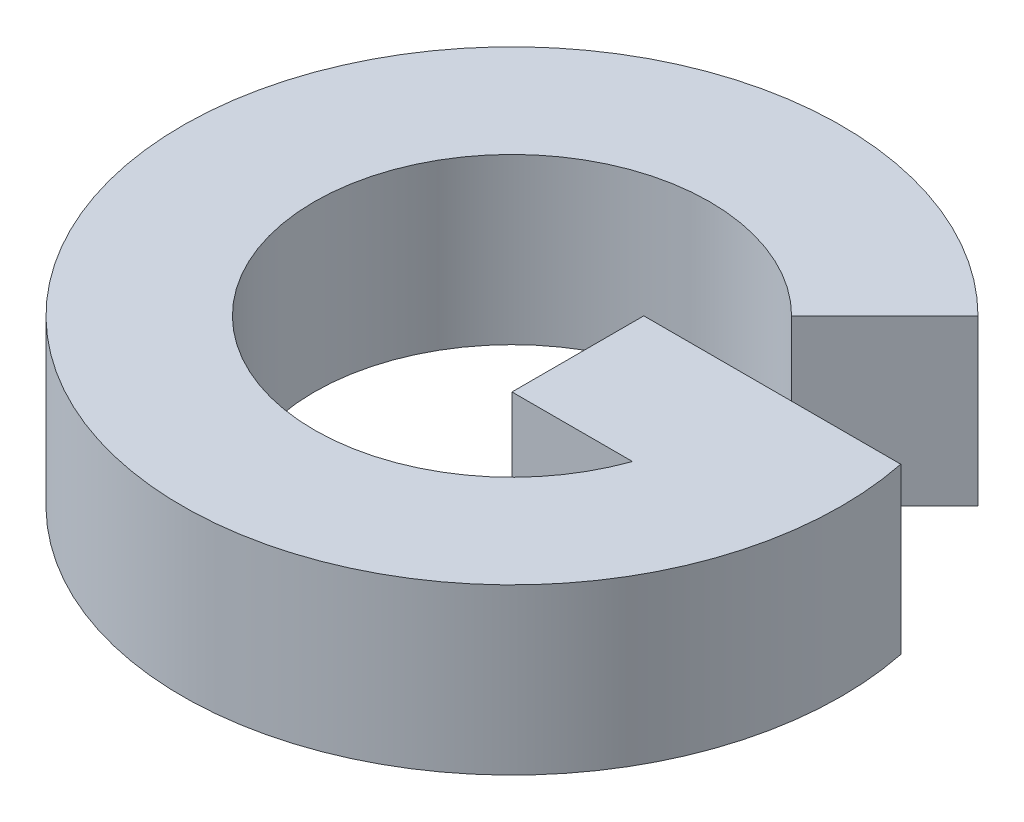
ISO-10303-21;
HEADER;
FILE_DESCRIPTION(('STEP AP214'),'2;1');
FILE_NAME('part.step','',(''),(''),'','','');
FILE_SCHEMA(('AUTOMOTIVE_DESIGN { 1 0 10303 214 1 1 1 1 }'));
ENDSEC;
DATA;
#1=APPLICATION_CONTEXT('core data for automotive mechanical design processes');
#2=APPLICATION_PROTOCOL_DEFINITION('international standard','automotive_design',2000,#1);
#3=PRODUCT_CONTEXT('',#1,'mechanical');
#4=PRODUCT('Part','Part','',(#3));
#5=PRODUCT_RELATED_PRODUCT_CATEGORY('part','',(#4));
#6=PRODUCT_DEFINITION_FORMATION('','',#4);
#7=PRODUCT_DEFINITION_CONTEXT('part definition',#1,'design');
#8=PRODUCT_DEFINITION('design','',#6,#7);
#9=PRODUCT_DEFINITION_SHAPE('','',#8);
#10=(LENGTH_UNIT() NAMED_UNIT(*) SI_UNIT(.MILLI.,.METRE.));
#11=(NAMED_UNIT(*) PLANE_ANGLE_UNIT() SI_UNIT($,.RADIAN.));
#12=(NAMED_UNIT(*) SI_UNIT($,.STERADIAN.) SOLID_ANGLE_UNIT());
#13=UNCERTAINTY_MEASURE_WITH_UNIT(LENGTH_MEASURE(1.E-05),#10,'distance_accuracy_value','');
#14=(GEOMETRIC_REPRESENTATION_CONTEXT(3) GLOBAL_UNCERTAINTY_ASSIGNED_CONTEXT((#13)) GLOBAL_UNIT_ASSIGNED_CONTEXT((#10,
#11,#12)) REPRESENTATION_CONTEXT('',''));
#15=CARTESIAN_POINT('',(0.,0.,0.));
#16=DIRECTION('',(0.,0.,1.));
#17=DIRECTION('',(1.,0.,0.));
#18=AXIS2_PLACEMENT_3D('',#15,#16,#17);
#19=CARTESIAN_POINT('',(320.,10.,-20.));
#20=DIRECTION('',(0.,-1.,0.));
#21=DIRECTION('',(0.,0.,-1.));
#22=AXIS2_PLACEMENT_3D('',#19,#20,#21);
#23=CYLINDRICAL_SURFACE('',#22,12.);
#24=CARTESIAN_POINT('',(320.,0.,-20.));
#25=DIRECTION('',(0.,-1.,0.));
#26=DIRECTION('',(0.,0.,1.));
#27=AXIS2_PLACEMENT_3D('',#24,#25,#26);
#28=CIRCLE('',#27,12.);
#29=CARTESIAN_POINT('',(331.313708498985,0.,-16.));
#30=VERTEX_POINT('',#29);
#31=CARTESIAN_POINT('',(328.485281374239,0.,-28.4852813742386));
#32=VERTEX_POINT('',#31);
#33=EDGE_CURVE('E116',#30,#32,#28,.T.);
#34=ORIENTED_EDGE('',*,*,#33,.T.);
#35=DIRECTION('',(0.,-1.,0.));
#36=VECTOR('',#35,1.);
#37=CARTESIAN_POINT('',(328.485281374239,10.,-28.4852813742386));
#38=LINE('',#37,#36);
#39=CARTESIAN_POINT('',(328.485281374239,10.,-28.4852813742386));
#40=VERTEX_POINT('',#39);
#41=EDGE_CURVE('E11',#40,#32,#38,.T.);
#42=ORIENTED_EDGE('',*,*,#41,.F.);
#43=CARTESIAN_POINT('',(320.,10.,-20.));
#44=DIRECTION('',(0.,-1.,0.));
#45=DIRECTION('',(0.,0.,1.));
#46=AXIS2_PLACEMENT_3D('',#43,#44,#45);
#47=CIRCLE('',#46,12.);
#48=CARTESIAN_POINT('',(331.313708498985,10.,-16.));
#49=VERTEX_POINT('',#48);
#50=EDGE_CURVE('E126',#49,#40,#47,.T.);
#51=ORIENTED_EDGE('',*,*,#50,.F.);
#52=DIRECTION('',(0.,-1.,0.));
#53=VECTOR('',#52,1.);
#54=CARTESIAN_POINT('',(331.313708498985,10.,-16.));
#55=LINE('',#54,#53);
#56=EDGE_CURVE('E112',#49,#30,#55,.T.);
#57=ORIENTED_EDGE('',*,*,#56,.T.);
#58=EDGE_LOOP('',(#34,#42,#51,#57));
#59=FACE_BOUND('',#58,.T.);
#60=ADVANCED_FACE('F32',(#59),#23,.F.);
#61=CARTESIAN_POINT('',(328.485281374239,10.,-28.4852813742386));
#62=DIRECTION('',(-0.707106781186549,0.,-0.707106781186546));
#63=DIRECTION('',(-0.707106781186546,0.,0.707106781186549));
#64=AXIS2_PLACEMENT_3D('',#61,#62,#63);
#65=PLANE('',#64);
#66=DIRECTION('',(0.707106781186546,0.,-0.707106781186549));
#67=VECTOR('',#66,1.);
#68=CARTESIAN_POINT('',(328.485281374239,0.,-28.4852813742386));
#69=LINE('',#68,#67);
#70=CARTESIAN_POINT('',(334.142135623731,0.,-34.142135623731));
#71=VERTEX_POINT('',#70);
#72=EDGE_CURVE('E119',#32,#71,#69,.T.);
#73=ORIENTED_EDGE('',*,*,#72,.T.);
#74=DIRECTION('',(0.,-1.,0.));
#75=VECTOR('',#74,1.);
#76=CARTESIAN_POINT('',(334.142135623731,10.,-34.142135623731));
#77=LINE('',#76,#75);
#78=CARTESIAN_POINT('',(334.142135623731,10.,-34.142135623731));
#79=VERTEX_POINT('',#78);
#80=EDGE_CURVE('E40',#79,#71,#77,.T.);
#81=ORIENTED_EDGE('',*,*,#80,.F.);
#82=DIRECTION('',(0.707106781186546,0.,-0.707106781186549));
#83=VECTOR('',#82,1.);
#84=CARTESIAN_POINT('',(328.485281374239,10.,-28.4852813742386));
#85=LINE('',#84,#83);
#86=EDGE_CURVE('E85',#40,#79,#85,.T.);
#87=ORIENTED_EDGE('',*,*,#86,.F.);
#88=ORIENTED_EDGE('',*,*,#41,.T.);
#89=EDGE_LOOP('',(#73,#81,#87,#88));
#90=FACE_BOUND('',#89,.T.);
#91=ADVANCED_FACE('F150',(#90),#65,.F.);
#92=CARTESIAN_POINT('',(320.,10.,-20.));
#93=DIRECTION('',(0.,-1.,0.));
#94=DIRECTION('',(0.,0.,-1.));
#95=AXIS2_PLACEMENT_3D('',#92,#93,#94);
#96=CYLINDRICAL_SURFACE('',#95,20.);
#97=CARTESIAN_POINT('',(320.,0.,-20.));
#98=DIRECTION('',(0.,1.,0.));
#99=DIRECTION('',(0.,0.,1.));
#100=AXIS2_PLACEMENT_3D('',#97,#98,#99);
#101=CIRCLE('',#100,20.);
#102=CARTESIAN_POINT('',(339.595917942265,0.,-24.));
#103=VERTEX_POINT('',#102);
#104=EDGE_CURVE('E121',#71,#103,#101,.T.);
#105=ORIENTED_EDGE('',*,*,#104,.T.);
#106=DIRECTION('',(0.,-1.,0.));
#107=VECTOR('',#106,1.);
#108=CARTESIAN_POINT('',(339.595917942265,10.,-24.));
#109=LINE('',#108,#107);
#110=CARTESIAN_POINT('',(339.595917942265,10.,-24.));
#111=VERTEX_POINT('',#110);
#112=EDGE_CURVE('E107',#111,#103,#109,.T.);
#113=ORIENTED_EDGE('',*,*,#112,.F.);
#114=CARTESIAN_POINT('',(320.,10.,-20.));
#115=DIRECTION('',(0.,1.,0.));
#116=DIRECTION('',(0.,0.,1.));
#117=AXIS2_PLACEMENT_3D('',#114,#115,#116);
#118=CIRCLE('',#117,20.);
#119=EDGE_CURVE('E98',#79,#111,#118,.T.);
#120=ORIENTED_EDGE('',*,*,#119,.F.);
#121=ORIENTED_EDGE('',*,*,#80,.T.);
#122=EDGE_LOOP('',(#105,#113,#120,#121));
#123=FACE_BOUND('',#122,.T.);
#124=ADVANCED_FACE('F132',(#123),#96,.T.);
#125=CARTESIAN_POINT('',(324.,10.,-24.));
#126=DIRECTION('',(0.,0.,1.));
#127=DIRECTION('',(1.,0.,0.));
#128=AXIS2_PLACEMENT_3D('',#125,#126,#127);
#129=PLANE('',#128);
#130=DIRECTION('',(-1.,0.,0.));
#131=VECTOR('',#130,1.);
#132=CARTESIAN_POINT('',(324.,0.,-24.));
#133=LINE('',#132,#131);
#134=CARTESIAN_POINT('',(324.,0.,-24.));
#135=VERTEX_POINT('',#134);
#136=EDGE_CURVE('E106',#103,#135,#133,.T.);
#137=ORIENTED_EDGE('',*,*,#136,.T.);
#138=DIRECTION('',(0.,-1.,0.));
#139=VECTOR('',#138,1.);
#140=CARTESIAN_POINT('',(324.,10.,-24.));
#141=LINE('',#140,#139);
#142=CARTESIAN_POINT('',(324.,10.,-24.));
#143=VERTEX_POINT('',#142);
#144=EDGE_CURVE('E103',#143,#135,#141,.T.);
#145=ORIENTED_EDGE('',*,*,#144,.F.);
#146=DIRECTION('',(-1.,0.,0.));
#147=VECTOR('',#146,1.);
#148=CARTESIAN_POINT('',(324.,10.,-24.));
#149=LINE('',#148,#147);
#150=EDGE_CURVE('E92',#111,#143,#149,.T.);
#151=ORIENTED_EDGE('',*,*,#150,.F.);
#152=ORIENTED_EDGE('',*,*,#112,.T.);
#153=EDGE_LOOP('',(#137,#145,#151,#152));
#154=FACE_BOUND('',#153,.T.);
#155=ADVANCED_FACE('F104',(#154),#129,.F.);
#156=CARTESIAN_POINT('',(324.,10.,-16.));
#157=DIRECTION('',(1.,0.,0.));
#158=DIRECTION('',(0.,0.,-1.));
#159=AXIS2_PLACEMENT_3D('',#156,#157,#158);
#160=PLANE('',#159);
#161=DIRECTION('',(0.,0.,1.));
#162=VECTOR('',#161,1.);
#163=CARTESIAN_POINT('',(324.,0.,-16.));
#164=LINE('',#163,#162);
#165=CARTESIAN_POINT('',(324.,0.,-16.));
#166=VERTEX_POINT('',#165);
#167=EDGE_CURVE('E71',#135,#166,#164,.T.);
#168=ORIENTED_EDGE('',*,*,#167,.T.);
#169=DIRECTION('',(0.,-1.,0.));
#170=VECTOR('',#169,1.);
#171=CARTESIAN_POINT('',(324.,10.,-16.));
#172=LINE('',#171,#170);
#173=CARTESIAN_POINT('',(324.,10.,-16.));
#174=VERTEX_POINT('',#173);
#175=EDGE_CURVE('E108',#174,#166,#172,.T.);
#176=ORIENTED_EDGE('',*,*,#175,.F.);
#177=DIRECTION('',(0.,0.,1.));
#178=VECTOR('',#177,1.);
#179=CARTESIAN_POINT('',(324.,10.,-16.));
#180=LINE('',#179,#178);
#181=EDGE_CURVE('E96',#143,#174,#180,.T.);
#182=ORIENTED_EDGE('',*,*,#181,.F.);
#183=ORIENTED_EDGE('',*,*,#144,.T.);
#184=EDGE_LOOP('',(#168,#176,#182,#183));
#185=FACE_BOUND('',#184,.T.);
#186=ADVANCED_FACE('F110',(#185),#160,.F.);
#187=CARTESIAN_POINT('',(324.,10.,-16.));
#188=DIRECTION('',(0.,0.,-1.));
#189=DIRECTION('',(-1.,0.,0.));
#190=AXIS2_PLACEMENT_3D('',#187,#188,#189);
#191=PLANE('',#190);
#192=DIRECTION('',(1.,0.,0.));
#193=VECTOR('',#192,1.);
#194=CARTESIAN_POINT('',(324.,0.,-16.));
#195=LINE('',#194,#193);
#196=EDGE_CURVE('E77',#166,#30,#195,.T.);
#197=ORIENTED_EDGE('',*,*,#196,.T.);
#198=ORIENTED_EDGE('',*,*,#56,.F.);
#199=DIRECTION('',(1.,0.,0.));
#200=VECTOR('',#199,1.);
#201=CARTESIAN_POINT('',(324.,10.,-16.));
#202=LINE('',#201,#200);
#203=EDGE_CURVE('E48',#174,#49,#202,.T.);
#204=ORIENTED_EDGE('',*,*,#203,.F.);
#205=ORIENTED_EDGE('',*,*,#175,.T.);
#206=EDGE_LOOP('',(#197,#198,#204,#205));
#207=FACE_BOUND('',#206,.T.);
#208=ADVANCED_FACE('F139',(#207),#191,.F.);
#209=CARTESIAN_POINT('',(320.,10.,-20.));
#210=DIRECTION('',(0.,1.,0.));
#211=DIRECTION('',(0.,0.,1.));
#212=AXIS2_PLACEMENT_3D('',#209,#210,#211);
#213=PLANE('',#212);
#214=ORIENTED_EDGE('',*,*,#50,.T.);
#215=ORIENTED_EDGE('',*,*,#86,.T.);
#216=ORIENTED_EDGE('',*,*,#119,.T.);
#217=ORIENTED_EDGE('',*,*,#150,.T.);
#218=ORIENTED_EDGE('',*,*,#181,.T.);
#219=ORIENTED_EDGE('',*,*,#203,.T.);
#220=EDGE_LOOP('',(#214,#215,#216,#217,#218,#219));
#221=FACE_BOUND('',#220,.T.);
#222=ADVANCED_FACE('F94',(#221),#213,.T.);
#223=CARTESIAN_POINT('',(320.,0.,-20.));
#224=DIRECTION('',(0.,1.,0.));
#225=DIRECTION('',(0.,0.,1.));
#226=AXIS2_PLACEMENT_3D('',#223,#224,#225);
#227=PLANE('',#226);
#228=ORIENTED_EDGE('',*,*,#33,.F.);
#229=ORIENTED_EDGE('',*,*,#196,.F.);
#230=ORIENTED_EDGE('',*,*,#167,.F.);
#231=ORIENTED_EDGE('',*,*,#136,.F.);
#232=ORIENTED_EDGE('',*,*,#104,.F.);
#233=ORIENTED_EDGE('',*,*,#72,.F.);
#234=EDGE_LOOP('',(#228,#229,#230,#231,#232,#233));
#235=FACE_BOUND('',#234,.T.);
#236=ADVANCED_FACE('F135',(#235),#227,.F.);
#237=CLOSED_SHELL('',(#60,#91,#124,#155,#186,#208,#222,#236));
#238=MANIFOLD_SOLID_BREP('B2',#237);
#239=ADVANCED_BREP_SHAPE_REPRESENTATION('',(#18,#238),#14);
#240=SHAPE_DEFINITION_REPRESENTATION(#9,#239);
ENDSEC;
END-ISO-10303-21;
